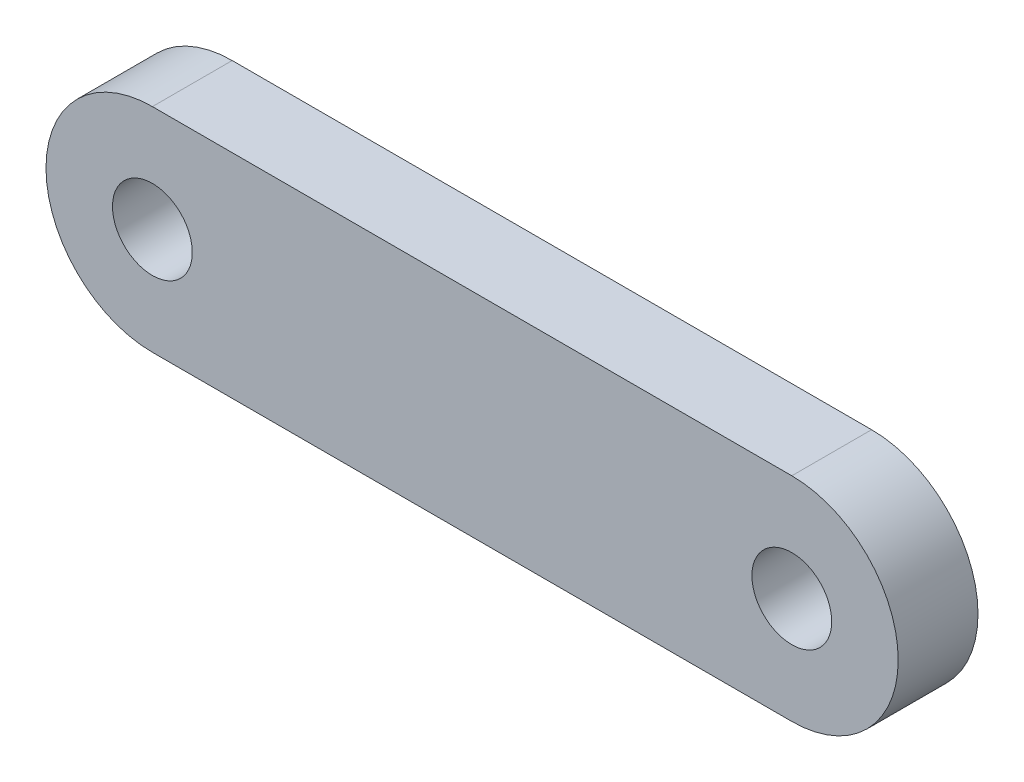
ISO-10303-21;
HEADER;
FILE_DESCRIPTION(('STEP AP214'),'2;1');
FILE_NAME('part.step','',(''),(''),'','','');
FILE_SCHEMA(('AUTOMOTIVE_DESIGN { 1 0 10303 214 1 1 1 1 }'));
ENDSEC;
DATA;
#1=APPLICATION_CONTEXT('core data for automotive mechanical design processes');
#2=APPLICATION_PROTOCOL_DEFINITION('international standard','automotive_design',2000,#1);
#3=PRODUCT_CONTEXT('',#1,'mechanical');
#4=PRODUCT('Part','Part','',(#3));
#5=PRODUCT_RELATED_PRODUCT_CATEGORY('part','',(#4));
#6=PRODUCT_DEFINITION_FORMATION('','',#4);
#7=PRODUCT_DEFINITION_CONTEXT('part definition',#1,'design');
#8=PRODUCT_DEFINITION('design','',#6,#7);
#9=PRODUCT_DEFINITION_SHAPE('','',#8);
#10=(LENGTH_UNIT() NAMED_UNIT(*) SI_UNIT(.MILLI.,.METRE.));
#11=(NAMED_UNIT(*) PLANE_ANGLE_UNIT() SI_UNIT($,.RADIAN.));
#12=(NAMED_UNIT(*) SI_UNIT($,.STERADIAN.) SOLID_ANGLE_UNIT());
#13=UNCERTAINTY_MEASURE_WITH_UNIT(LENGTH_MEASURE(1.E-05),#10,'distance_accuracy_value','');
#14=(GEOMETRIC_REPRESENTATION_CONTEXT(3) GLOBAL_UNCERTAINTY_ASSIGNED_CONTEXT((#13)) GLOBAL_UNIT_ASSIGNED_CONTEXT((#10,
#11,#12)) REPRESENTATION_CONTEXT('',''));
#15=CARTESIAN_POINT('',(0.,0.,0.));
#16=DIRECTION('',(0.,0.,1.));
#17=DIRECTION('',(1.,0.,0.));
#18=AXIS2_PLACEMENT_3D('',#15,#16,#17);
#19=CARTESIAN_POINT('',(0.,0.,0.75));
#20=DIRECTION('',(0.,0.,1.));
#21=DIRECTION('',(-1.,0.,0.));
#22=AXIS2_PLACEMENT_3D('',#19,#20,#21);
#23=PLANE('',#22);
#24=CARTESIAN_POINT('',(0.,0.,0.75));
#25=DIRECTION('',(0.,0.,-1.));
#26=DIRECTION('',(-1.,0.,0.));
#27=AXIS2_PLACEMENT_3D('',#24,#25,#26);
#28=CIRCLE('',#27,0.75);
#29=CARTESIAN_POINT('',(-0.75,0.,0.75));
#30=VERTEX_POINT('',#29);
#31=EDGE_CURVE('E105',#30,#30,#28,.T.);
#32=ORIENTED_EDGE('',*,*,#31,.T.);
#33=EDGE_LOOP('',(#32));
#34=FACE_BOUND('',#33,.T.);
#35=CARTESIAN_POINT('',(0.,0.,0.75));
#36=DIRECTION('',(0.,0.,-1.));
#37=DIRECTION('',(-1.,0.,0.));
#38=AXIS2_PLACEMENT_3D('',#35,#36,#37);
#39=CIRCLE('',#38,2.);
#40=CARTESIAN_POINT('',(0.,2.,0.75));
#41=VERTEX_POINT('',#40);
#42=CARTESIAN_POINT('',(0.,-2.,0.75));
#43=VERTEX_POINT('',#42);
#44=EDGE_CURVE('E93',#41,#43,#39,.T.);
#45=ORIENTED_EDGE('',*,*,#44,.F.);
#46=DIRECTION('',(1.,0.,0.));
#47=VECTOR('',#46,1.);
#48=CARTESIAN_POINT('',(0.,2.,0.75));
#49=LINE('',#48,#47);
#50=CARTESIAN_POINT('',(-12.02,2.,0.75));
#51=VERTEX_POINT('',#50);
#52=EDGE_CURVE('E96',#51,#41,#49,.T.);
#53=ORIENTED_EDGE('',*,*,#52,.F.);
#54=CARTESIAN_POINT('',(-12.02,0.,0.75));
#55=DIRECTION('',(0.,0.,-1.));
#56=DIRECTION('',(-1.,0.,0.));
#57=AXIS2_PLACEMENT_3D('',#54,#55,#56);
#58=CIRCLE('',#57,2.);
#59=CARTESIAN_POINT('',(-12.02,-2.,0.75));
#60=VERTEX_POINT('',#59);
#61=EDGE_CURVE('E84',#60,#51,#58,.T.);
#62=ORIENTED_EDGE('',*,*,#61,.F.);
#63=DIRECTION('',(-1.,0.,0.));
#64=VECTOR('',#63,1.);
#65=CARTESIAN_POINT('',(0.,-2.,0.75));
#66=LINE('',#65,#64);
#67=EDGE_CURVE('E89',#43,#60,#66,.T.);
#68=ORIENTED_EDGE('',*,*,#67,.F.);
#69=EDGE_LOOP('',(#45,#53,#62,#68));
#70=FACE_BOUND('',#69,.T.);
#71=CARTESIAN_POINT('',(-12.02,0.,0.75));
#72=DIRECTION('',(0.,0.,-1.));
#73=DIRECTION('',(-1.,0.,0.));
#74=AXIS2_PLACEMENT_3D('',#71,#72,#73);
#75=CIRCLE('',#74,0.750000000000002);
#76=CARTESIAN_POINT('',(-12.77,0.,0.75));
#77=VERTEX_POINT('',#76);
#78=EDGE_CURVE('E116',#77,#77,#75,.T.);
#79=ORIENTED_EDGE('',*,*,#78,.T.);
#80=EDGE_LOOP('',(#79));
#81=FACE_BOUND('',#80,.T.);
#82=ADVANCED_FACE('F37',(#34,#70,#81),#23,.T.);
#83=CARTESIAN_POINT('',(0.,0.,-0.75));
#84=DIRECTION('',(0.,0.,1.));
#85=DIRECTION('',(-1.,0.,0.));
#86=AXIS2_PLACEMENT_3D('',#83,#84,#85);
#87=PLANE('',#86);
#88=CARTESIAN_POINT('',(0.,0.,-0.75));
#89=DIRECTION('',(0.,0.,-1.));
#90=DIRECTION('',(-1.,0.,0.));
#91=AXIS2_PLACEMENT_3D('',#88,#89,#90);
#92=CIRCLE('',#91,2.);
#93=CARTESIAN_POINT('',(0.,2.,-0.75));
#94=VERTEX_POINT('',#93);
#95=CARTESIAN_POINT('',(0.,-2.,-0.75));
#96=VERTEX_POINT('',#95);
#97=EDGE_CURVE('E101',#94,#96,#92,.T.);
#98=ORIENTED_EDGE('',*,*,#97,.T.);
#99=DIRECTION('',(-1.,0.,0.));
#100=VECTOR('',#99,1.);
#101=CARTESIAN_POINT('',(0.,-2.,-0.75));
#102=LINE('',#101,#100);
#103=CARTESIAN_POINT('',(-12.02,-2.,-0.75));
#104=VERTEX_POINT('',#103);
#105=EDGE_CURVE('E104',#96,#104,#102,.T.);
#106=ORIENTED_EDGE('',*,*,#105,.T.);
#107=CARTESIAN_POINT('',(-12.02,0.,-0.75));
#108=DIRECTION('',(0.,0.,-1.));
#109=DIRECTION('',(-1.,0.,0.));
#110=AXIS2_PLACEMENT_3D('',#107,#108,#109);
#111=CIRCLE('',#110,2.);
#112=CARTESIAN_POINT('',(-12.02,2.,-0.75));
#113=VERTEX_POINT('',#112);
#114=EDGE_CURVE('E87',#104,#113,#111,.T.);
#115=ORIENTED_EDGE('',*,*,#114,.T.);
#116=DIRECTION('',(1.,0.,0.));
#117=VECTOR('',#116,1.);
#118=CARTESIAN_POINT('',(0.,2.,-0.75));
#119=LINE('',#118,#117);
#120=EDGE_CURVE('E108',#113,#94,#119,.T.);
#121=ORIENTED_EDGE('',*,*,#120,.T.);
#122=EDGE_LOOP('',(#98,#106,#115,#121));
#123=FACE_BOUND('',#122,.T.);
#124=CARTESIAN_POINT('',(0.,0.,-0.75));
#125=DIRECTION('',(0.,0.,-1.));
#126=DIRECTION('',(-1.,0.,0.));
#127=AXIS2_PLACEMENT_3D('',#124,#125,#126);
#128=CIRCLE('',#127,0.75);
#129=CARTESIAN_POINT('',(-0.75,0.,-0.75));
#130=VERTEX_POINT('',#129);
#131=EDGE_CURVE('E113',#130,#130,#128,.T.);
#132=ORIENTED_EDGE('',*,*,#131,.F.);
#133=EDGE_LOOP('',(#132));
#134=FACE_BOUND('',#133,.T.);
#135=CARTESIAN_POINT('',(-12.02,0.,-0.75));
#136=DIRECTION('',(0.,0.,-1.));
#137=DIRECTION('',(-1.,0.,0.));
#138=AXIS2_PLACEMENT_3D('',#135,#136,#137);
#139=CIRCLE('',#138,0.750000000000002);
#140=CARTESIAN_POINT('',(-12.77,0.,-0.75));
#141=VERTEX_POINT('',#140);
#142=EDGE_CURVE('E119',#141,#141,#139,.T.);
#143=ORIENTED_EDGE('',*,*,#142,.F.);
#144=EDGE_LOOP('',(#143));
#145=FACE_BOUND('',#144,.T.);
#146=ADVANCED_FACE('F132',(#123,#134,#145),#87,.F.);
#147=CARTESIAN_POINT('',(0.,0.,0.75));
#148=DIRECTION('',(0.,0.,-1.));
#149=DIRECTION('',(1.,0.,0.));
#150=AXIS2_PLACEMENT_3D('',#147,#148,#149);
#151=CYLINDRICAL_SURFACE('',#150,2.);
#152=ORIENTED_EDGE('',*,*,#97,.F.);
#153=DIRECTION('',(0.,0.,-1.));
#154=VECTOR('',#153,1.);
#155=CARTESIAN_POINT('',(0.,2.,0.75));
#156=LINE('',#155,#154);
#157=EDGE_CURVE('E54',#41,#94,#156,.T.);
#158=ORIENTED_EDGE('',*,*,#157,.F.);
#159=ORIENTED_EDGE('',*,*,#44,.T.);
#160=DIRECTION('',(0.,0.,-1.));
#161=VECTOR('',#160,1.);
#162=CARTESIAN_POINT('',(0.,-2.,0.75));
#163=LINE('',#162,#161);
#164=EDGE_CURVE('E11',#43,#96,#163,.T.);
#165=ORIENTED_EDGE('',*,*,#164,.T.);
#166=EDGE_LOOP('',(#152,#158,#159,#165));
#167=FACE_BOUND('',#166,.T.);
#168=ADVANCED_FACE('F39',(#167),#151,.T.);
#169=CARTESIAN_POINT('',(0.,-2.,0.75));
#170=DIRECTION('',(0.,1.,0.));
#171=DIRECTION('',(0.,0.,1.));
#172=AXIS2_PLACEMENT_3D('',#169,#170,#171);
#173=PLANE('',#172);
#174=ORIENTED_EDGE('',*,*,#105,.F.);
#175=ORIENTED_EDGE('',*,*,#164,.F.);
#176=ORIENTED_EDGE('',*,*,#67,.T.);
#177=DIRECTION('',(0.,0.,-1.));
#178=VECTOR('',#177,1.);
#179=CARTESIAN_POINT('',(-12.02,-2.,0.75));
#180=LINE('',#179,#178);
#181=EDGE_CURVE('E46',#60,#104,#180,.T.);
#182=ORIENTED_EDGE('',*,*,#181,.T.);
#183=EDGE_LOOP('',(#174,#175,#176,#182));
#184=FACE_BOUND('',#183,.T.);
#185=ADVANCED_FACE('F90',(#184),#173,.F.);
#186=CARTESIAN_POINT('',(-12.02,0.,0.75));
#187=DIRECTION('',(0.,0.,-1.));
#188=DIRECTION('',(1.,0.,0.));
#189=AXIS2_PLACEMENT_3D('',#186,#187,#188);
#190=CYLINDRICAL_SURFACE('',#189,2.);
#191=ORIENTED_EDGE('',*,*,#114,.F.);
#192=ORIENTED_EDGE('',*,*,#181,.F.);
#193=ORIENTED_EDGE('',*,*,#61,.T.);
#194=DIRECTION('',(0.,0.,-1.));
#195=VECTOR('',#194,1.);
#196=CARTESIAN_POINT('',(-12.02,2.,0.75));
#197=LINE('',#196,#195);
#198=EDGE_CURVE('E70',#51,#113,#197,.T.);
#199=ORIENTED_EDGE('',*,*,#198,.T.);
#200=EDGE_LOOP('',(#191,#192,#193,#199));
#201=FACE_BOUND('',#200,.T.);
#202=ADVANCED_FACE('F82',(#201),#190,.T.);
#203=CARTESIAN_POINT('',(0.,2.,0.75));
#204=DIRECTION('',(0.,-1.,0.));
#205=DIRECTION('',(0.,0.,-1.));
#206=AXIS2_PLACEMENT_3D('',#203,#204,#205);
#207=PLANE('',#206);
#208=ORIENTED_EDGE('',*,*,#120,.F.);
#209=ORIENTED_EDGE('',*,*,#198,.F.);
#210=ORIENTED_EDGE('',*,*,#52,.T.);
#211=ORIENTED_EDGE('',*,*,#157,.T.);
#212=EDGE_LOOP('',(#208,#209,#210,#211));
#213=FACE_BOUND('',#212,.T.);
#214=ADVANCED_FACE('F144',(#213),#207,.F.);
#215=CARTESIAN_POINT('',(0.,0.,0.75));
#216=DIRECTION('',(0.,0.,-1.));
#217=DIRECTION('',(1.,0.,0.));
#218=AXIS2_PLACEMENT_3D('',#215,#216,#217);
#219=CYLINDRICAL_SURFACE('',#218,0.75);
#220=ORIENTED_EDGE('',*,*,#31,.F.);
#221=EDGE_LOOP('',(#220));
#222=FACE_BOUND('',#221,.T.);
#223=ORIENTED_EDGE('',*,*,#131,.T.);
#224=EDGE_LOOP('',(#223));
#225=FACE_BOUND('',#224,.T.);
#226=ADVANCED_FACE('F128',(#222,#225),#219,.F.);
#227=CARTESIAN_POINT('',(-12.02,0.,0.75));
#228=DIRECTION('',(0.,0.,-1.));
#229=DIRECTION('',(1.,0.,0.));
#230=AXIS2_PLACEMENT_3D('',#227,#228,#229);
#231=CYLINDRICAL_SURFACE('',#230,0.750000000000002);
#232=ORIENTED_EDGE('',*,*,#78,.F.);
#233=EDGE_LOOP('',(#232));
#234=FACE_BOUND('',#233,.T.);
#235=ORIENTED_EDGE('',*,*,#142,.T.);
#236=EDGE_LOOP('',(#235));
#237=FACE_BOUND('',#236,.T.);
#238=ADVANCED_FACE('F125',(#234,#237),#231,.F.);
#239=CLOSED_SHELL('',(#82,#146,#168,#185,#202,#214,#226,#238));
#240=MANIFOLD_SOLID_BREP('B2',#239);
#241=ADVANCED_BREP_SHAPE_REPRESENTATION('',(#18,#240),#14);
#242=SHAPE_DEFINITION_REPRESENTATION(#9,#241);
ENDSEC;
END-ISO-10303-21;
